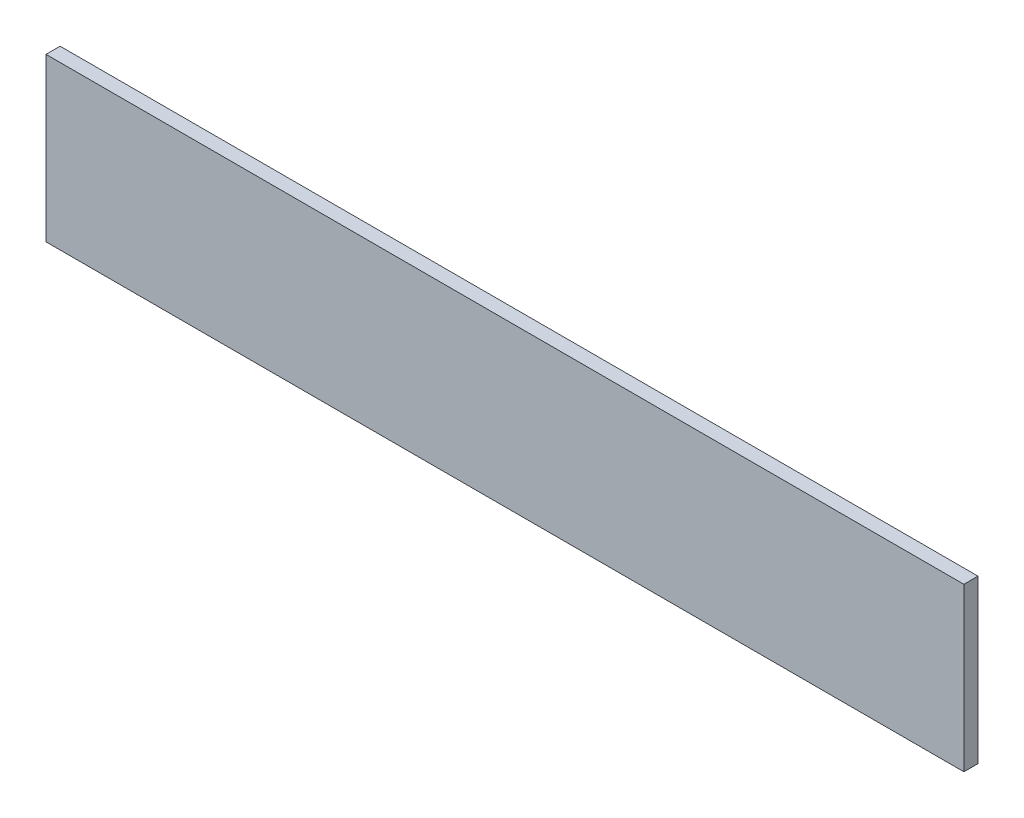
ISO-10303-21;
HEADER;
FILE_DESCRIPTION(('STEP AP214'),'2;1');
FILE_NAME('part.step','',(''),(''),'','','');
FILE_SCHEMA(('AUTOMOTIVE_DESIGN { 1 0 10303 214 1 1 1 1 }'));
ENDSEC;
DATA;
#1=APPLICATION_CONTEXT('core data for automotive mechanical design processes');
#2=APPLICATION_PROTOCOL_DEFINITION('international standard','automotive_design',2000,#1);
#3=PRODUCT_CONTEXT('',#1,'mechanical');
#4=PRODUCT('Part','Part','',(#3));
#5=PRODUCT_RELATED_PRODUCT_CATEGORY('part','',(#4));
#6=PRODUCT_DEFINITION_FORMATION('','',#4);
#7=PRODUCT_DEFINITION_CONTEXT('part definition',#1,'design');
#8=PRODUCT_DEFINITION('design','',#6,#7);
#9=PRODUCT_DEFINITION_SHAPE('','',#8);
#10=(LENGTH_UNIT() NAMED_UNIT(*) SI_UNIT(.MILLI.,.METRE.));
#11=(NAMED_UNIT(*) PLANE_ANGLE_UNIT() SI_UNIT($,.RADIAN.));
#12=(NAMED_UNIT(*) SI_UNIT($,.STERADIAN.) SOLID_ANGLE_UNIT());
#13=UNCERTAINTY_MEASURE_WITH_UNIT(LENGTH_MEASURE(1.E-05),#10,'distance_accuracy_value','');
#14=(GEOMETRIC_REPRESENTATION_CONTEXT(3) GLOBAL_UNCERTAINTY_ASSIGNED_CONTEXT((#13)) GLOBAL_UNIT_ASSIGNED_CONTEXT((#10,
#11,#12)) REPRESENTATION_CONTEXT('',''));
#15=CARTESIAN_POINT('',(0.,0.,0.));
#16=DIRECTION('',(0.,0.,1.));
#17=DIRECTION('',(1.,0.,0.));
#18=AXIS2_PLACEMENT_3D('',#15,#16,#17);
#19=CARTESIAN_POINT('',(0.,0.,4.));
#20=DIRECTION('',(1.,0.,0.));
#21=DIRECTION('',(0.,0.,-1.));
#22=AXIS2_PLACEMENT_3D('',#19,#20,#21);
#23=PLANE('',#22);
#24=DIRECTION('',(0.,-1.,0.));
#25=VECTOR('',#24,1.);
#26=CARTESIAN_POINT('',(0.,0.,0.));
#27=LINE('',#26,#25);
#28=CARTESIAN_POINT('',(0.,46.,0.));
#29=VERTEX_POINT('',#28);
#30=CARTESIAN_POINT('',(0.,0.,0.));
#31=VERTEX_POINT('',#30);
#32=EDGE_CURVE('E99',#29,#31,#27,.T.);
#33=ORIENTED_EDGE('',*,*,#32,.T.);
#34=DIRECTION('',(0.,0.,-1.));
#35=VECTOR('',#34,1.);
#36=CARTESIAN_POINT('',(0.,0.,4.));
#37=LINE('',#36,#35);
#38=CARTESIAN_POINT('',(0.,0.,4.));
#39=VERTEX_POINT('',#38);
#40=EDGE_CURVE('E11',#39,#31,#37,.T.);
#41=ORIENTED_EDGE('',*,*,#40,.F.);
#42=DIRECTION('',(0.,-1.,0.));
#43=VECTOR('',#42,1.);
#44=CARTESIAN_POINT('',(0.,0.,4.));
#45=LINE('',#44,#43);
#46=CARTESIAN_POINT('',(0.,46.,4.));
#47=VERTEX_POINT('',#46);
#48=EDGE_CURVE('E87',#47,#39,#45,.T.);
#49=ORIENTED_EDGE('',*,*,#48,.F.);
#50=DIRECTION('',(0.,0.,-1.));
#51=VECTOR('',#50,1.);
#52=CARTESIAN_POINT('',(0.,46.,4.));
#53=LINE('',#52,#51);
#54=EDGE_CURVE('E95',#47,#29,#53,.T.);
#55=ORIENTED_EDGE('',*,*,#54,.T.);
#56=EDGE_LOOP('',(#33,#41,#49,#55));
#57=FACE_BOUND('',#56,.T.);
#58=ADVANCED_FACE('F36',(#57),#23,.F.);
#59=CARTESIAN_POINT('',(0.,0.,4.));
#60=DIRECTION('',(0.,1.,0.));
#61=DIRECTION('',(0.,0.,1.));
#62=AXIS2_PLACEMENT_3D('',#59,#60,#61);
#63=PLANE('',#62);
#64=DIRECTION('',(1.,0.,0.));
#65=VECTOR('',#64,1.);
#66=CARTESIAN_POINT('',(0.,0.,0.));
#67=LINE('',#66,#65);
#68=CARTESIAN_POINT('',(260.,0.,0.));
#69=VERTEX_POINT('',#68);
#70=EDGE_CURVE('E91',#31,#69,#67,.T.);
#71=ORIENTED_EDGE('',*,*,#70,.T.);
#72=DIRECTION('',(0.,0.,-1.));
#73=VECTOR('',#72,1.);
#74=CARTESIAN_POINT('',(260.,0.,4.));
#75=LINE('',#74,#73);
#76=CARTESIAN_POINT('',(260.,0.,4.));
#77=VERTEX_POINT('',#76);
#78=EDGE_CURVE('E44',#77,#69,#75,.T.);
#79=ORIENTED_EDGE('',*,*,#78,.F.);
#80=DIRECTION('',(1.,0.,0.));
#81=VECTOR('',#80,1.);
#82=CARTESIAN_POINT('',(0.,0.,4.));
#83=LINE('',#82,#81);
#84=EDGE_CURVE('E82',#39,#77,#83,.T.);
#85=ORIENTED_EDGE('',*,*,#84,.F.);
#86=ORIENTED_EDGE('',*,*,#40,.T.);
#87=EDGE_LOOP('',(#71,#79,#85,#86));
#88=FACE_BOUND('',#87,.T.);
#89=ADVANCED_FACE('F90',(#88),#63,.F.);
#90=CARTESIAN_POINT('',(260.,0.,4.));
#91=DIRECTION('',(-1.,0.,0.));
#92=DIRECTION('',(0.,0.,1.));
#93=AXIS2_PLACEMENT_3D('',#90,#91,#92);
#94=PLANE('',#93);
#95=DIRECTION('',(0.,1.,0.));
#96=VECTOR('',#95,1.);
#97=CARTESIAN_POINT('',(260.,0.,0.));
#98=LINE('',#97,#96);
#99=CARTESIAN_POINT('',(260.,46.,0.));
#100=VERTEX_POINT('',#99);
#101=EDGE_CURVE('E69',#69,#100,#98,.T.);
#102=ORIENTED_EDGE('',*,*,#101,.T.);
#103=DIRECTION('',(0.,0.,-1.));
#104=VECTOR('',#103,1.);
#105=CARTESIAN_POINT('',(260.,46.,4.));
#106=LINE('',#105,#104);
#107=CARTESIAN_POINT('',(260.,46.,4.));
#108=VERTEX_POINT('',#107);
#109=EDGE_CURVE('E92',#108,#100,#106,.T.);
#110=ORIENTED_EDGE('',*,*,#109,.F.);
#111=DIRECTION('',(0.,1.,0.));
#112=VECTOR('',#111,1.);
#113=CARTESIAN_POINT('',(260.,0.,4.));
#114=LINE('',#113,#112);
#115=EDGE_CURVE('E85',#77,#108,#114,.T.);
#116=ORIENTED_EDGE('',*,*,#115,.F.);
#117=ORIENTED_EDGE('',*,*,#78,.T.);
#118=EDGE_LOOP('',(#102,#110,#116,#117));
#119=FACE_BOUND('',#118,.T.);
#120=ADVANCED_FACE('F93',(#119),#94,.F.);
#121=CARTESIAN_POINT('',(0.,46.,4.));
#122=DIRECTION('',(0.,-1.,0.));
#123=DIRECTION('',(0.,0.,-1.));
#124=AXIS2_PLACEMENT_3D('',#121,#122,#123);
#125=PLANE('',#124);
#126=DIRECTION('',(-1.,0.,0.));
#127=VECTOR('',#126,1.);
#128=CARTESIAN_POINT('',(0.,46.,0.));
#129=LINE('',#128,#127);
#130=EDGE_CURVE('E75',#100,#29,#129,.T.);
#131=ORIENTED_EDGE('',*,*,#130,.T.);
#132=ORIENTED_EDGE('',*,*,#54,.F.);
#133=DIRECTION('',(-1.,0.,0.));
#134=VECTOR('',#133,1.);
#135=CARTESIAN_POINT('',(0.,46.,4.));
#136=LINE('',#135,#134);
#137=EDGE_CURVE('E52',#108,#47,#136,.T.);
#138=ORIENTED_EDGE('',*,*,#137,.F.);
#139=ORIENTED_EDGE('',*,*,#109,.T.);
#140=EDGE_LOOP('',(#131,#132,#138,#139));
#141=FACE_BOUND('',#140,.T.);
#142=ADVANCED_FACE('F106',(#141),#125,.F.);
#143=CARTESIAN_POINT('',(0.,46.,4.));
#144=DIRECTION('',(0.,0.,-1.));
#145=DIRECTION('',(-1.,0.,0.));
#146=AXIS2_PLACEMENT_3D('',#143,#144,#145);
#147=PLANE('',#146);
#148=ORIENTED_EDGE('',*,*,#48,.T.);
#149=ORIENTED_EDGE('',*,*,#84,.T.);
#150=ORIENTED_EDGE('',*,*,#115,.T.);
#151=ORIENTED_EDGE('',*,*,#137,.T.);
#152=EDGE_LOOP('',(#148,#149,#150,#151));
#153=FACE_BOUND('',#152,.T.);
#154=ADVANCED_FACE('F83',(#153),#147,.F.);
#155=CARTESIAN_POINT('',(0.,46.,0.));
#156=DIRECTION('',(0.,0.,-1.));
#157=DIRECTION('',(-1.,0.,0.));
#158=AXIS2_PLACEMENT_3D('',#155,#156,#157);
#159=PLANE('',#158);
#160=ORIENTED_EDGE('',*,*,#32,.F.);
#161=ORIENTED_EDGE('',*,*,#130,.F.);
#162=ORIENTED_EDGE('',*,*,#101,.F.);
#163=ORIENTED_EDGE('',*,*,#70,.F.);
#164=EDGE_LOOP('',(#160,#161,#162,#163));
#165=FACE_BOUND('',#164,.T.);
#166=ADVANCED_FACE('F109',(#165),#159,.T.);
#167=CLOSED_SHELL('',(#58,#89,#120,#142,#154,#166));
#168=MANIFOLD_SOLID_BREP('B2',#167);
#169=ADVANCED_BREP_SHAPE_REPRESENTATION('',(#18,#168),#14);
#170=SHAPE_DEFINITION_REPRESENTATION(#9,#169);
ENDSEC;
END-ISO-10303-21;
